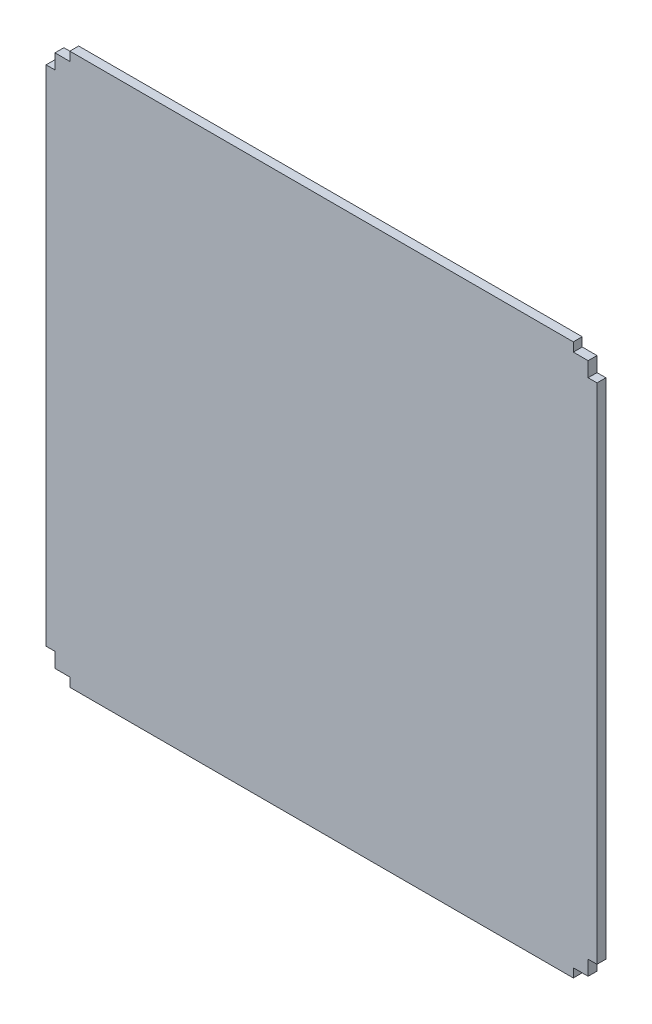
ISO-10303-21;
HEADER;
FILE_DESCRIPTION(('STEP AP214'),'2;1');
FILE_NAME('part.step','',(''),(''),'','','');
FILE_SCHEMA(('AUTOMOTIVE_DESIGN { 1 0 10303 214 1 1 1 1 }'));
ENDSEC;
DATA;
#1=APPLICATION_CONTEXT('core data for automotive mechanical design processes');
#2=APPLICATION_PROTOCOL_DEFINITION('international standard','automotive_design',2000,#1);
#3=PRODUCT_CONTEXT('',#1,'mechanical');
#4=PRODUCT('Part','Part','',(#3));
#5=PRODUCT_RELATED_PRODUCT_CATEGORY('part','',(#4));
#6=PRODUCT_DEFINITION_FORMATION('','',#4);
#7=PRODUCT_DEFINITION_CONTEXT('part definition',#1,'design');
#8=PRODUCT_DEFINITION('design','',#6,#7);
#9=PRODUCT_DEFINITION_SHAPE('','',#8);
#10=(LENGTH_UNIT() NAMED_UNIT(*) SI_UNIT(.MILLI.,.METRE.));
#11=(NAMED_UNIT(*) PLANE_ANGLE_UNIT() SI_UNIT($,.RADIAN.));
#12=(NAMED_UNIT(*) SI_UNIT($,.STERADIAN.) SOLID_ANGLE_UNIT());
#13=UNCERTAINTY_MEASURE_WITH_UNIT(LENGTH_MEASURE(1.E-05),#10,'distance_accuracy_value','');
#14=(GEOMETRIC_REPRESENTATION_CONTEXT(3) GLOBAL_UNCERTAINTY_ASSIGNED_CONTEXT((#13)) GLOBAL_UNIT_ASSIGNED_CONTEXT((#10,
#11,#12)) REPRESENTATION_CONTEXT('',''));
#15=CARTESIAN_POINT('',(0.,0.,0.));
#16=DIRECTION('',(0.,0.,1.));
#17=DIRECTION('',(1.,0.,0.));
#18=AXIS2_PLACEMENT_3D('',#15,#16,#17);
#19=CARTESIAN_POINT('',(0.,0.,3.));
#20=DIRECTION('',(1.,0.,0.));
#21=DIRECTION('',(0.,0.,-1.));
#22=AXIS2_PLACEMENT_3D('',#19,#20,#21);
#23=PLANE('',#22);
#24=DIRECTION('',(0.,-1.,0.));
#25=VECTOR('',#24,1.);
#26=CARTESIAN_POINT('',(0.,0.,0.));
#27=LINE('',#26,#25);
#28=CARTESIAN_POINT('',(0.,5.,0.));
#29=VERTEX_POINT('',#28);
#30=CARTESIAN_POINT('',(0.,0.,0.));
#31=VERTEX_POINT('',#30);
#32=EDGE_CURVE('E212',#29,#31,#27,.T.);
#33=ORIENTED_EDGE('',*,*,#32,.T.);
#34=DIRECTION('',(0.,0.,-1.));
#35=VECTOR('',#34,1.);
#36=CARTESIAN_POINT('',(0.,0.,3.));
#37=LINE('',#36,#35);
#38=CARTESIAN_POINT('',(0.,0.,3.));
#39=VERTEX_POINT('',#38);
#40=EDGE_CURVE('E11',#39,#31,#37,.T.);
#41=ORIENTED_EDGE('',*,*,#40,.F.);
#42=DIRECTION('',(0.,-1.,0.));
#43=VECTOR('',#42,1.);
#44=CARTESIAN_POINT('',(0.,0.,3.));
#45=LINE('',#44,#43);
#46=CARTESIAN_POINT('',(0.,5.,3.));
#47=VERTEX_POINT('',#46);
#48=EDGE_CURVE('E270',#47,#39,#45,.T.);
#49=ORIENTED_EDGE('',*,*,#48,.F.);
#50=DIRECTION('',(0.,0.,-1.));
#51=VECTOR('',#50,1.);
#52=CARTESIAN_POINT('',(0.,5.,3.));
#53=LINE('',#52,#51);
#54=EDGE_CURVE('E208',#47,#29,#53,.T.);
#55=ORIENTED_EDGE('',*,*,#54,.T.);
#56=EDGE_LOOP('',(#33,#41,#49,#55));
#57=FACE_BOUND('',#56,.T.);
#58=ADVANCED_FACE('F39',(#57),#23,.F.);
#59=CARTESIAN_POINT('',(0.,0.,3.));
#60=DIRECTION('',(0.,1.,0.));
#61=DIRECTION('',(0.,0.,1.));
#62=AXIS2_PLACEMENT_3D('',#59,#60,#61);
#63=PLANE('',#62);
#64=DIRECTION('',(1.,0.,0.));
#65=VECTOR('',#64,1.);
#66=CARTESIAN_POINT('',(0.,0.,0.));
#67=LINE('',#66,#65);
#68=CARTESIAN_POINT('',(5.,0.,0.));
#69=VERTEX_POINT('',#68);
#70=EDGE_CURVE('E216',#31,#69,#67,.T.);
#71=ORIENTED_EDGE('',*,*,#70,.T.);
#72=DIRECTION('',(0.,0.,-1.));
#73=VECTOR('',#72,1.);
#74=CARTESIAN_POINT('',(5.,0.,3.));
#75=LINE('',#74,#73);
#76=CARTESIAN_POINT('',(5.,0.,3.));
#77=VERTEX_POINT('',#76);
#78=EDGE_CURVE('E48',#77,#69,#75,.T.);
#79=ORIENTED_EDGE('',*,*,#78,.F.);
#80=DIRECTION('',(1.,0.,0.));
#81=VECTOR('',#80,1.);
#82=CARTESIAN_POINT('',(0.,0.,3.));
#83=LINE('',#82,#81);
#84=EDGE_CURVE('E135',#39,#77,#83,.T.);
#85=ORIENTED_EDGE('',*,*,#84,.F.);
#86=ORIENTED_EDGE('',*,*,#40,.T.);
#87=EDGE_LOOP('',(#71,#79,#85,#86));
#88=FACE_BOUND('',#87,.T.);
#89=ADVANCED_FACE('F420',(#88),#63,.F.);
#90=CARTESIAN_POINT('',(5.,0.,3.));
#91=DIRECTION('',(1.,0.,0.));
#92=DIRECTION('',(0.,0.,-1.));
#93=AXIS2_PLACEMENT_3D('',#90,#91,#92);
#94=PLANE('',#93);
#95=DIRECTION('',(0.,-1.,0.));
#96=VECTOR('',#95,1.);
#97=CARTESIAN_POINT('',(5.,0.,0.));
#98=LINE('',#97,#96);
#99=CARTESIAN_POINT('',(5.,-3.,0.));
#100=VERTEX_POINT('',#99);
#101=EDGE_CURVE('E219',#69,#100,#98,.T.);
#102=ORIENTED_EDGE('',*,*,#101,.T.);
#103=DIRECTION('',(0.,0.,-1.));
#104=VECTOR('',#103,1.);
#105=CARTESIAN_POINT('',(5.,-3.,3.));
#106=LINE('',#105,#104);
#107=CARTESIAN_POINT('',(5.,-3.,3.));
#108=VERTEX_POINT('',#107);
#109=EDGE_CURVE('E329',#108,#100,#106,.T.);
#110=ORIENTED_EDGE('',*,*,#109,.F.);
#111=DIRECTION('',(0.,-1.,0.));
#112=VECTOR('',#111,1.);
#113=CARTESIAN_POINT('',(5.,0.,3.));
#114=LINE('',#113,#112);
#115=EDGE_CURVE('E339',#77,#108,#114,.T.);
#116=ORIENTED_EDGE('',*,*,#115,.F.);
#117=ORIENTED_EDGE('',*,*,#78,.T.);
#118=EDGE_LOOP('',(#102,#110,#116,#117));
#119=FACE_BOUND('',#118,.T.);
#120=ADVANCED_FACE('F337',(#119),#94,.F.);
#121=CARTESIAN_POINT('',(5.,-3.,3.));
#122=DIRECTION('',(0.,1.,0.));
#123=DIRECTION('',(0.,0.,1.));
#124=AXIS2_PLACEMENT_3D('',#121,#122,#123);
#125=PLANE('',#124);
#126=DIRECTION('',(1.,0.,0.));
#127=VECTOR('',#126,1.);
#128=CARTESIAN_POINT('',(5.,-3.,0.));
#129=LINE('',#128,#127);
#130=CARTESIAN_POINT('',(175.,-3.,0.));
#131=VERTEX_POINT('',#130);
#132=EDGE_CURVE('E222',#100,#131,#129,.T.);
#133=ORIENTED_EDGE('',*,*,#132,.T.);
#134=DIRECTION('',(0.,0.,-1.));
#135=VECTOR('',#134,1.);
#136=CARTESIAN_POINT('',(175.,-3.,3.));
#137=LINE('',#136,#135);
#138=CARTESIAN_POINT('',(175.,-3.,3.));
#139=VERTEX_POINT('',#138);
#140=EDGE_CURVE('E325',#139,#131,#137,.T.);
#141=ORIENTED_EDGE('',*,*,#140,.F.);
#142=DIRECTION('',(1.,0.,0.));
#143=VECTOR('',#142,1.);
#144=CARTESIAN_POINT('',(5.,-3.,3.));
#145=LINE('',#144,#143);
#146=EDGE_CURVE('E358',#108,#139,#145,.T.);
#147=ORIENTED_EDGE('',*,*,#146,.F.);
#148=ORIENTED_EDGE('',*,*,#109,.T.);
#149=EDGE_LOOP('',(#133,#141,#147,#148));
#150=FACE_BOUND('',#149,.T.);
#151=ADVANCED_FACE('F348',(#150),#125,.F.);
#152=CARTESIAN_POINT('',(175.,-3.,3.));
#153=DIRECTION('',(-1.,0.,0.));
#154=DIRECTION('',(0.,-1.,0.));
#155=AXIS2_PLACEMENT_3D('',#152,#153,#154);
#156=PLANE('',#155);
#157=DIRECTION('',(0.,1.,0.));
#158=VECTOR('',#157,1.);
#159=CARTESIAN_POINT('',(175.,-3.,0.));
#160=LINE('',#159,#158);
#161=CARTESIAN_POINT('',(175.,0.,0.));
#162=VERTEX_POINT('',#161);
#163=EDGE_CURVE('E225',#131,#162,#160,.T.);
#164=ORIENTED_EDGE('',*,*,#163,.T.);
#165=DIRECTION('',(0.,0.,-1.));
#166=VECTOR('',#165,1.);
#167=CARTESIAN_POINT('',(175.,0.,3.));
#168=LINE('',#167,#166);
#169=CARTESIAN_POINT('',(175.,0.,3.));
#170=VERTEX_POINT('',#169);
#171=EDGE_CURVE('E321',#170,#162,#168,.T.);
#172=ORIENTED_EDGE('',*,*,#171,.F.);
#173=DIRECTION('',(0.,1.,0.));
#174=VECTOR('',#173,1.);
#175=CARTESIAN_POINT('',(175.,-3.,3.));
#176=LINE('',#175,#174);
#177=EDGE_CURVE('E354',#139,#170,#176,.T.);
#178=ORIENTED_EDGE('',*,*,#177,.F.);
#179=ORIENTED_EDGE('',*,*,#140,.T.);
#180=EDGE_LOOP('',(#164,#172,#178,#179));
#181=FACE_BOUND('',#180,.T.);
#182=ADVANCED_FACE('F352',(#181),#156,.F.);
#183=CARTESIAN_POINT('',(175.,0.,3.));
#184=DIRECTION('',(0.,1.,0.));
#185=DIRECTION('',(-1.,0.,0.));
#186=AXIS2_PLACEMENT_3D('',#183,#184,#185);
#187=PLANE('',#186);
#188=DIRECTION('',(1.,0.,0.));
#189=VECTOR('',#188,1.);
#190=CARTESIAN_POINT('',(175.,0.,0.));
#191=LINE('',#190,#189);
#192=CARTESIAN_POINT('',(180.,0.,0.));
#193=VERTEX_POINT('',#192);
#194=EDGE_CURVE('E228',#162,#193,#191,.T.);
#195=ORIENTED_EDGE('',*,*,#194,.T.);
#196=DIRECTION('',(0.,0.,-1.));
#197=VECTOR('',#196,1.);
#198=CARTESIAN_POINT('',(180.,0.,3.));
#199=LINE('',#198,#197);
#200=CARTESIAN_POINT('',(180.,0.,3.));
#201=VERTEX_POINT('',#200);
#202=EDGE_CURVE('E317',#201,#193,#199,.T.);
#203=ORIENTED_EDGE('',*,*,#202,.F.);
#204=DIRECTION('',(1.,0.,0.));
#205=VECTOR('',#204,1.);
#206=CARTESIAN_POINT('',(175.,0.,3.));
#207=LINE('',#206,#205);
#208=EDGE_CURVE('E357',#170,#201,#207,.T.);
#209=ORIENTED_EDGE('',*,*,#208,.F.);
#210=ORIENTED_EDGE('',*,*,#171,.T.);
#211=EDGE_LOOP('',(#195,#203,#209,#210));
#212=FACE_BOUND('',#211,.T.);
#213=ADVANCED_FACE('F433',(#212),#187,.F.);
#214=CARTESIAN_POINT('',(180.,0.,3.));
#215=DIRECTION('',(-1.,0.,0.));
#216=DIRECTION('',(0.,0.,1.));
#217=AXIS2_PLACEMENT_3D('',#214,#215,#216);
#218=PLANE('',#217);
#219=DIRECTION('',(0.,1.,0.));
#220=VECTOR('',#219,1.);
#221=CARTESIAN_POINT('',(180.,0.,0.));
#222=LINE('',#221,#220);
#223=CARTESIAN_POINT('',(180.,5.,0.));
#224=VERTEX_POINT('',#223);
#225=EDGE_CURVE('E231',#193,#224,#222,.T.);
#226=ORIENTED_EDGE('',*,*,#225,.T.);
#227=DIRECTION('',(0.,0.,-1.));
#228=VECTOR('',#227,1.);
#229=CARTESIAN_POINT('',(180.,5.,3.));
#230=LINE('',#229,#228);
#231=CARTESIAN_POINT('',(180.,5.,3.));
#232=VERTEX_POINT('',#231);
#233=EDGE_CURVE('E313',#232,#224,#230,.T.);
#234=ORIENTED_EDGE('',*,*,#233,.F.);
#235=DIRECTION('',(0.,1.,0.));
#236=VECTOR('',#235,1.);
#237=CARTESIAN_POINT('',(180.,0.,3.));
#238=LINE('',#237,#236);
#239=EDGE_CURVE('E362',#201,#232,#238,.T.);
#240=ORIENTED_EDGE('',*,*,#239,.F.);
#241=ORIENTED_EDGE('',*,*,#202,.T.);
#242=EDGE_LOOP('',(#226,#234,#240,#241));
#243=FACE_BOUND('',#242,.T.);
#244=ADVANCED_FACE('F436',(#243),#218,.F.);
#245=CARTESIAN_POINT('',(180.,5.,3.));
#246=DIRECTION('',(0.,1.,0.));
#247=DIRECTION('',(0.,0.,1.));
#248=AXIS2_PLACEMENT_3D('',#245,#246,#247);
#249=PLANE('',#248);
#250=DIRECTION('',(1.,0.,0.));
#251=VECTOR('',#250,1.);
#252=CARTESIAN_POINT('',(180.,5.,0.));
#253=LINE('',#252,#251);
#254=CARTESIAN_POINT('',(183.,5.,0.));
#255=VERTEX_POINT('',#254);
#256=EDGE_CURVE('E234',#224,#255,#253,.T.);
#257=ORIENTED_EDGE('',*,*,#256,.T.);
#258=DIRECTION('',(0.,0.,-1.));
#259=VECTOR('',#258,1.);
#260=CARTESIAN_POINT('',(183.,5.,3.));
#261=LINE('',#260,#259);
#262=CARTESIAN_POINT('',(183.,5.,3.));
#263=VERTEX_POINT('',#262);
#264=EDGE_CURVE('E309',#263,#255,#261,.T.);
#265=ORIENTED_EDGE('',*,*,#264,.F.);
#266=DIRECTION('',(1.,0.,0.));
#267=VECTOR('',#266,1.);
#268=CARTESIAN_POINT('',(180.,5.,3.));
#269=LINE('',#268,#267);
#270=EDGE_CURVE('E369',#232,#263,#269,.T.);
#271=ORIENTED_EDGE('',*,*,#270,.F.);
#272=ORIENTED_EDGE('',*,*,#233,.T.);
#273=EDGE_LOOP('',(#257,#265,#271,#272));
#274=FACE_BOUND('',#273,.T.);
#275=ADVANCED_FACE('F440',(#274),#249,.F.);
#276=CARTESIAN_POINT('',(183.,5.,3.));
#277=DIRECTION('',(-1.,0.,0.));
#278=DIRECTION('',(0.,0.,1.));
#279=AXIS2_PLACEMENT_3D('',#276,#277,#278);
#280=PLANE('',#279);
#281=DIRECTION('',(0.,1.,0.));
#282=VECTOR('',#281,1.);
#283=CARTESIAN_POINT('',(183.,5.,0.));
#284=LINE('',#283,#282);
#285=CARTESIAN_POINT('',(183.,175.,0.));
#286=VERTEX_POINT('',#285);
#287=EDGE_CURVE('E237',#255,#286,#284,.T.);
#288=ORIENTED_EDGE('',*,*,#287,.T.);
#289=DIRECTION('',(0.,0.,-1.));
#290=VECTOR('',#289,1.);
#291=CARTESIAN_POINT('',(183.,175.,3.));
#292=LINE('',#291,#290);
#293=CARTESIAN_POINT('',(183.,175.,3.));
#294=VERTEX_POINT('',#293);
#295=EDGE_CURVE('E305',#294,#286,#292,.T.);
#296=ORIENTED_EDGE('',*,*,#295,.F.);
#297=DIRECTION('',(0.,1.,0.));
#298=VECTOR('',#297,1.);
#299=CARTESIAN_POINT('',(183.,5.,3.));
#300=LINE('',#299,#298);
#301=EDGE_CURVE('E372',#263,#294,#300,.T.);
#302=ORIENTED_EDGE('',*,*,#301,.F.);
#303=ORIENTED_EDGE('',*,*,#264,.T.);
#304=EDGE_LOOP('',(#288,#296,#302,#303));
#305=FACE_BOUND('',#304,.T.);
#306=ADVANCED_FACE('F444',(#305),#280,.F.);
#307=CARTESIAN_POINT('',(183.,175.,3.));
#308=DIRECTION('',(0.,-1.,0.));
#309=DIRECTION('',(1.,0.,0.));
#310=AXIS2_PLACEMENT_3D('',#307,#308,#309);
#311=PLANE('',#310);
#312=DIRECTION('',(-1.,0.,0.));
#313=VECTOR('',#312,1.);
#314=CARTESIAN_POINT('',(183.,175.,0.));
#315=LINE('',#314,#313);
#316=CARTESIAN_POINT('',(180.,175.,0.));
#317=VERTEX_POINT('',#316);
#318=EDGE_CURVE('E240',#286,#317,#315,.T.);
#319=ORIENTED_EDGE('',*,*,#318,.T.);
#320=DIRECTION('',(0.,0.,-1.));
#321=VECTOR('',#320,1.);
#322=CARTESIAN_POINT('',(180.,175.,3.));
#323=LINE('',#322,#321);
#324=CARTESIAN_POINT('',(180.,175.,3.));
#325=VERTEX_POINT('',#324);
#326=EDGE_CURVE('E301',#325,#317,#323,.T.);
#327=ORIENTED_EDGE('',*,*,#326,.F.);
#328=DIRECTION('',(-1.,0.,0.));
#329=VECTOR('',#328,1.);
#330=CARTESIAN_POINT('',(183.,175.,3.));
#331=LINE('',#330,#329);
#332=EDGE_CURVE('E375',#294,#325,#331,.T.);
#333=ORIENTED_EDGE('',*,*,#332,.F.);
#334=ORIENTED_EDGE('',*,*,#295,.T.);
#335=EDGE_LOOP('',(#319,#327,#333,#334));
#336=FACE_BOUND('',#335,.T.);
#337=ADVANCED_FACE('F448',(#336),#311,.F.);
#338=CARTESIAN_POINT('',(180.,175.,3.));
#339=DIRECTION('',(-1.,0.,0.));
#340=DIRECTION('',(0.,0.,1.));
#341=AXIS2_PLACEMENT_3D('',#338,#339,#340);
#342=PLANE('',#341);
#343=DIRECTION('',(0.,1.,0.));
#344=VECTOR('',#343,1.);
#345=CARTESIAN_POINT('',(180.,175.,0.));
#346=LINE('',#345,#344);
#347=CARTESIAN_POINT('',(180.,180.,0.));
#348=VERTEX_POINT('',#347);
#349=EDGE_CURVE('E243',#317,#348,#346,.T.);
#350=ORIENTED_EDGE('',*,*,#349,.T.);
#351=DIRECTION('',(0.,0.,-1.));
#352=VECTOR('',#351,1.);
#353=CARTESIAN_POINT('',(180.,180.,3.));
#354=LINE('',#353,#352);
#355=CARTESIAN_POINT('',(180.,180.,3.));
#356=VERTEX_POINT('',#355);
#357=EDGE_CURVE('E297',#356,#348,#354,.T.);
#358=ORIENTED_EDGE('',*,*,#357,.F.);
#359=DIRECTION('',(0.,1.,0.));
#360=VECTOR('',#359,1.);
#361=CARTESIAN_POINT('',(180.,175.,3.));
#362=LINE('',#361,#360);
#363=EDGE_CURVE('E378',#325,#356,#362,.T.);
#364=ORIENTED_EDGE('',*,*,#363,.F.);
#365=ORIENTED_EDGE('',*,*,#326,.T.);
#366=EDGE_LOOP('',(#350,#358,#364,#365));
#367=FACE_BOUND('',#366,.T.);
#368=ADVANCED_FACE('F452',(#367),#342,.F.);
#369=CARTESIAN_POINT('',(180.,180.,3.));
#370=DIRECTION('',(0.,-1.,0.));
#371=DIRECTION('',(0.,0.,-1.));
#372=AXIS2_PLACEMENT_3D('',#369,#370,#371);
#373=PLANE('',#372);
#374=DIRECTION('',(-1.,0.,0.));
#375=VECTOR('',#374,1.);
#376=CARTESIAN_POINT('',(180.,180.,0.));
#377=LINE('',#376,#375);
#378=CARTESIAN_POINT('',(175.,180.,0.));
#379=VERTEX_POINT('',#378);
#380=EDGE_CURVE('E246',#348,#379,#377,.T.);
#381=ORIENTED_EDGE('',*,*,#380,.T.);
#382=DIRECTION('',(0.,0.,-1.));
#383=VECTOR('',#382,1.);
#384=CARTESIAN_POINT('',(175.,180.,3.));
#385=LINE('',#384,#383);
#386=CARTESIAN_POINT('',(175.,180.,3.));
#387=VERTEX_POINT('',#386);
#388=EDGE_CURVE('E293',#387,#379,#385,.T.);
#389=ORIENTED_EDGE('',*,*,#388,.F.);
#390=DIRECTION('',(-1.,0.,0.));
#391=VECTOR('',#390,1.);
#392=CARTESIAN_POINT('',(180.,180.,3.));
#393=LINE('',#392,#391);
#394=EDGE_CURVE('E381',#356,#387,#393,.T.);
#395=ORIENTED_EDGE('',*,*,#394,.F.);
#396=ORIENTED_EDGE('',*,*,#357,.T.);
#397=EDGE_LOOP('',(#381,#389,#395,#396));
#398=FACE_BOUND('',#397,.T.);
#399=ADVANCED_FACE('F456',(#398),#373,.F.);
#400=CARTESIAN_POINT('',(175.,180.,3.));
#401=DIRECTION('',(-1.,0.,0.));
#402=DIRECTION('',(0.,0.,1.));
#403=AXIS2_PLACEMENT_3D('',#400,#401,#402);
#404=PLANE('',#403);
#405=DIRECTION('',(0.,1.,0.));
#406=VECTOR('',#405,1.);
#407=CARTESIAN_POINT('',(175.,180.,0.));
#408=LINE('',#407,#406);
#409=CARTESIAN_POINT('',(175.,183.,0.));
#410=VERTEX_POINT('',#409);
#411=EDGE_CURVE('E249',#379,#410,#408,.T.);
#412=ORIENTED_EDGE('',*,*,#411,.T.);
#413=DIRECTION('',(0.,0.,-1.));
#414=VECTOR('',#413,1.);
#415=CARTESIAN_POINT('',(175.,183.,3.));
#416=LINE('',#415,#414);
#417=CARTESIAN_POINT('',(175.,183.,3.));
#418=VERTEX_POINT('',#417);
#419=EDGE_CURVE('E289',#418,#410,#416,.T.);
#420=ORIENTED_EDGE('',*,*,#419,.F.);
#421=DIRECTION('',(0.,1.,0.));
#422=VECTOR('',#421,1.);
#423=CARTESIAN_POINT('',(175.,180.,3.));
#424=LINE('',#423,#422);
#425=EDGE_CURVE('E384',#387,#418,#424,.T.);
#426=ORIENTED_EDGE('',*,*,#425,.F.);
#427=ORIENTED_EDGE('',*,*,#388,.T.);
#428=EDGE_LOOP('',(#412,#420,#426,#427));
#429=FACE_BOUND('',#428,.T.);
#430=ADVANCED_FACE('F460',(#429),#404,.F.);
#431=CARTESIAN_POINT('',(175.,183.,3.));
#432=DIRECTION('',(0.,-1.,0.));
#433=DIRECTION('',(0.,0.,-1.));
#434=AXIS2_PLACEMENT_3D('',#431,#432,#433);
#435=PLANE('',#434);
#436=DIRECTION('',(-1.,0.,0.));
#437=VECTOR('',#436,1.);
#438=CARTESIAN_POINT('',(175.,183.,0.));
#439=LINE('',#438,#437);
#440=CARTESIAN_POINT('',(5.,183.,0.));
#441=VERTEX_POINT('',#440);
#442=EDGE_CURVE('E252',#410,#441,#439,.T.);
#443=ORIENTED_EDGE('',*,*,#442,.T.);
#444=DIRECTION('',(0.,0.,-1.));
#445=VECTOR('',#444,1.);
#446=CARTESIAN_POINT('',(5.,183.,3.));
#447=LINE('',#446,#445);
#448=CARTESIAN_POINT('',(5.,183.,3.));
#449=VERTEX_POINT('',#448);
#450=EDGE_CURVE('E285',#449,#441,#447,.T.);
#451=ORIENTED_EDGE('',*,*,#450,.F.);
#452=DIRECTION('',(-1.,0.,0.));
#453=VECTOR('',#452,1.);
#454=CARTESIAN_POINT('',(175.,183.,3.));
#455=LINE('',#454,#453);
#456=EDGE_CURVE('E387',#418,#449,#455,.T.);
#457=ORIENTED_EDGE('',*,*,#456,.F.);
#458=ORIENTED_EDGE('',*,*,#419,.T.);
#459=EDGE_LOOP('',(#443,#451,#457,#458));
#460=FACE_BOUND('',#459,.T.);
#461=ADVANCED_FACE('F464',(#460),#435,.F.);
#462=CARTESIAN_POINT('',(5.,183.,3.));
#463=DIRECTION('',(1.,0.,0.));
#464=DIRECTION('',(0.,1.,0.));
#465=AXIS2_PLACEMENT_3D('',#462,#463,#464);
#466=PLANE('',#465);
#467=DIRECTION('',(0.,-1.,0.));
#468=VECTOR('',#467,1.);
#469=CARTESIAN_POINT('',(5.,183.,0.));
#470=LINE('',#469,#468);
#471=CARTESIAN_POINT('',(5.,180.,0.));
#472=VERTEX_POINT('',#471);
#473=EDGE_CURVE('E255',#441,#472,#470,.T.);
#474=ORIENTED_EDGE('',*,*,#473,.T.);
#475=DIRECTION('',(0.,0.,-1.));
#476=VECTOR('',#475,1.);
#477=CARTESIAN_POINT('',(5.,180.,3.));
#478=LINE('',#477,#476);
#479=CARTESIAN_POINT('',(5.,180.,3.));
#480=VERTEX_POINT('',#479);
#481=EDGE_CURVE('E281',#480,#472,#478,.T.);
#482=ORIENTED_EDGE('',*,*,#481,.F.);
#483=DIRECTION('',(0.,-1.,0.));
#484=VECTOR('',#483,1.);
#485=CARTESIAN_POINT('',(5.,183.,3.));
#486=LINE('',#485,#484);
#487=EDGE_CURVE('E390',#449,#480,#486,.T.);
#488=ORIENTED_EDGE('',*,*,#487,.F.);
#489=ORIENTED_EDGE('',*,*,#450,.T.);
#490=EDGE_LOOP('',(#474,#482,#488,#489));
#491=FACE_BOUND('',#490,.T.);
#492=ADVANCED_FACE('F468',(#491),#466,.F.);
#493=CARTESIAN_POINT('',(0.,180.,3.));
#494=DIRECTION('',(0.,-1.,0.));
#495=DIRECTION('',(0.,0.,-1.));
#496=AXIS2_PLACEMENT_3D('',#493,#494,#495);
#497=PLANE('',#496);
#498=DIRECTION('',(-1.,0.,0.));
#499=VECTOR('',#498,1.);
#500=CARTESIAN_POINT('',(0.,180.,0.));
#501=LINE('',#500,#499);
#502=CARTESIAN_POINT('',(0.,180.,0.));
#503=VERTEX_POINT('',#502);
#504=EDGE_CURVE('E258',#472,#503,#501,.T.);
#505=ORIENTED_EDGE('',*,*,#504,.T.);
#506=DIRECTION('',(0.,0.,-1.));
#507=VECTOR('',#506,1.);
#508=CARTESIAN_POINT('',(0.,180.,3.));
#509=LINE('',#508,#507);
#510=CARTESIAN_POINT('',(0.,180.,3.));
#511=VERTEX_POINT('',#510);
#512=EDGE_CURVE('E277',#511,#503,#509,.T.);
#513=ORIENTED_EDGE('',*,*,#512,.F.);
#514=DIRECTION('',(-1.,0.,0.));
#515=VECTOR('',#514,1.);
#516=CARTESIAN_POINT('',(0.,180.,3.));
#517=LINE('',#516,#515);
#518=EDGE_CURVE('E393',#480,#511,#517,.T.);
#519=ORIENTED_EDGE('',*,*,#518,.F.);
#520=ORIENTED_EDGE('',*,*,#481,.T.);
#521=EDGE_LOOP('',(#505,#513,#519,#520));
#522=FACE_BOUND('',#521,.T.);
#523=ADVANCED_FACE('F401',(#522),#497,.F.);
#524=CARTESIAN_POINT('',(0.,180.,3.));
#525=DIRECTION('',(1.,0.,0.));
#526=DIRECTION('',(0.,0.,-1.));
#527=AXIS2_PLACEMENT_3D('',#524,#525,#526);
#528=PLANE('',#527);
#529=DIRECTION('',(0.,-1.,0.));
#530=VECTOR('',#529,1.);
#531=CARTESIAN_POINT('',(0.,180.,0.));
#532=LINE('',#531,#530);
#533=CARTESIAN_POINT('',(0.,175.,0.));
#534=VERTEX_POINT('',#533);
#535=EDGE_CURVE('E261',#503,#534,#532,.T.);
#536=ORIENTED_EDGE('',*,*,#535,.T.);
#537=DIRECTION('',(0.,0.,-1.));
#538=VECTOR('',#537,1.);
#539=CARTESIAN_POINT('',(0.,175.,3.));
#540=LINE('',#539,#538);
#541=CARTESIAN_POINT('',(0.,175.,3.));
#542=VERTEX_POINT('',#541);
#543=EDGE_CURVE('E201',#542,#534,#540,.T.);
#544=ORIENTED_EDGE('',*,*,#543,.F.);
#545=DIRECTION('',(0.,-1.,0.));
#546=VECTOR('',#545,1.);
#547=CARTESIAN_POINT('',(0.,180.,3.));
#548=LINE('',#547,#546);
#549=EDGE_CURVE('E190',#511,#542,#548,.T.);
#550=ORIENTED_EDGE('',*,*,#549,.F.);
#551=ORIENTED_EDGE('',*,*,#512,.T.);
#552=EDGE_LOOP('',(#536,#544,#550,#551));
#553=FACE_BOUND('',#552,.T.);
#554=ADVANCED_FACE('F405',(#553),#528,.F.);
#555=CARTESIAN_POINT('',(0.,175.,3.));
#556=DIRECTION('',(0.,-1.,0.));
#557=DIRECTION('',(0.,0.,-1.));
#558=AXIS2_PLACEMENT_3D('',#555,#556,#557);
#559=PLANE('',#558);
#560=DIRECTION('',(-1.,0.,0.));
#561=VECTOR('',#560,1.);
#562=CARTESIAN_POINT('',(0.,175.,0.));
#563=LINE('',#562,#561);
#564=CARTESIAN_POINT('',(-3.,175.,0.));
#565=VERTEX_POINT('',#564);
#566=EDGE_CURVE('E199',#534,#565,#563,.T.);
#567=ORIENTED_EDGE('',*,*,#566,.T.);
#568=DIRECTION('',(0.,0.,-1.));
#569=VECTOR('',#568,1.);
#570=CARTESIAN_POINT('',(-3.,175.,3.));
#571=LINE('',#570,#569);
#572=CARTESIAN_POINT('',(-3.,175.,3.));
#573=VERTEX_POINT('',#572);
#574=EDGE_CURVE('E196',#573,#565,#571,.T.);
#575=ORIENTED_EDGE('',*,*,#574,.F.);
#576=DIRECTION('',(-1.,0.,0.));
#577=VECTOR('',#576,1.);
#578=CARTESIAN_POINT('',(0.,175.,3.));
#579=LINE('',#578,#577);
#580=EDGE_CURVE('E184',#542,#573,#579,.T.);
#581=ORIENTED_EDGE('',*,*,#580,.F.);
#582=ORIENTED_EDGE('',*,*,#543,.T.);
#583=EDGE_LOOP('',(#567,#575,#581,#582));
#584=FACE_BOUND('',#583,.T.);
#585=ADVANCED_FACE('F197',(#584),#559,.F.);
#586=CARTESIAN_POINT('',(-3.,5.,3.));
#587=DIRECTION('',(1.,0.,0.));
#588=DIRECTION('',(0.,0.,-1.));
#589=AXIS2_PLACEMENT_3D('',#586,#587,#588);
#590=PLANE('',#589);
#591=DIRECTION('',(0.,-1.,0.));
#592=VECTOR('',#591,1.);
#593=CARTESIAN_POINT('',(-3.,5.,0.));
#594=LINE('',#593,#592);
#595=CARTESIAN_POINT('',(-3.,5.,0.));
#596=VERTEX_POINT('',#595);
#597=EDGE_CURVE('E121',#565,#596,#594,.T.);
#598=ORIENTED_EDGE('',*,*,#597,.T.);
#599=DIRECTION('',(0.,0.,-1.));
#600=VECTOR('',#599,1.);
#601=CARTESIAN_POINT('',(-3.,5.,3.));
#602=LINE('',#601,#600);
#603=CARTESIAN_POINT('',(-3.,5.,3.));
#604=VERTEX_POINT('',#603);
#605=EDGE_CURVE('E202',#604,#596,#602,.T.);
#606=ORIENTED_EDGE('',*,*,#605,.F.);
#607=DIRECTION('',(0.,-1.,0.));
#608=VECTOR('',#607,1.);
#609=CARTESIAN_POINT('',(-3.,5.,3.));
#610=LINE('',#609,#608);
#611=EDGE_CURVE('E188',#573,#604,#610,.T.);
#612=ORIENTED_EDGE('',*,*,#611,.F.);
#613=ORIENTED_EDGE('',*,*,#574,.T.);
#614=EDGE_LOOP('',(#598,#606,#612,#613));
#615=FACE_BOUND('',#614,.T.);
#616=ADVANCED_FACE('F204',(#615),#590,.F.);
#617=CARTESIAN_POINT('',(0.,5.,3.));
#618=DIRECTION('',(0.,1.,0.));
#619=DIRECTION('',(0.,0.,1.));
#620=AXIS2_PLACEMENT_3D('',#617,#618,#619);
#621=PLANE('',#620);
#622=DIRECTION('',(1.,0.,0.));
#623=VECTOR('',#622,1.);
#624=CARTESIAN_POINT('',(0.,5.,0.));
#625=LINE('',#624,#623);
#626=EDGE_CURVE('E127',#596,#29,#625,.T.);
#627=ORIENTED_EDGE('',*,*,#626,.T.);
#628=ORIENTED_EDGE('',*,*,#54,.F.);
#629=DIRECTION('',(1.,0.,0.));
#630=VECTOR('',#629,1.);
#631=CARTESIAN_POINT('',(0.,5.,3.));
#632=LINE('',#631,#630);
#633=EDGE_CURVE('E56',#604,#47,#632,.T.);
#634=ORIENTED_EDGE('',*,*,#633,.F.);
#635=ORIENTED_EDGE('',*,*,#605,.T.);
#636=EDGE_LOOP('',(#627,#628,#634,#635));
#637=FACE_BOUND('',#636,.T.);
#638=ADVANCED_FACE('F409',(#637),#621,.F.);
#639=CARTESIAN_POINT('',(0.,0.,3.));
#640=DIRECTION('',(0.,0.,1.));
#641=DIRECTION('',(1.,0.,0.));
#642=AXIS2_PLACEMENT_3D('',#639,#640,#641);
#643=PLANE('',#642);
#644=ORIENTED_EDGE('',*,*,#48,.T.);
#645=ORIENTED_EDGE('',*,*,#84,.T.);
#646=ORIENTED_EDGE('',*,*,#115,.T.);
#647=ORIENTED_EDGE('',*,*,#146,.T.);
#648=ORIENTED_EDGE('',*,*,#177,.T.);
#649=ORIENTED_EDGE('',*,*,#208,.T.);
#650=ORIENTED_EDGE('',*,*,#239,.T.);
#651=ORIENTED_EDGE('',*,*,#270,.T.);
#652=ORIENTED_EDGE('',*,*,#301,.T.);
#653=ORIENTED_EDGE('',*,*,#332,.T.);
#654=ORIENTED_EDGE('',*,*,#363,.T.);
#655=ORIENTED_EDGE('',*,*,#394,.T.);
#656=ORIENTED_EDGE('',*,*,#425,.T.);
#657=ORIENTED_EDGE('',*,*,#456,.T.);
#658=ORIENTED_EDGE('',*,*,#487,.T.);
#659=ORIENTED_EDGE('',*,*,#518,.T.);
#660=ORIENTED_EDGE('',*,*,#549,.T.);
#661=ORIENTED_EDGE('',*,*,#580,.T.);
#662=ORIENTED_EDGE('',*,*,#611,.T.);
#663=ORIENTED_EDGE('',*,*,#633,.T.);
#664=EDGE_LOOP('',(#644,#645,#646,#647,#648,#649,#650,#651,#652,#653,#654,#655,#656,#657,#658,
#659,#660,#661,#662,#663));
#665=FACE_BOUND('',#664,.T.);
#666=ADVANCED_FACE('F186',(#665),#643,.T.);
#667=CARTESIAN_POINT('',(0.,0.,0.));
#668=DIRECTION('',(0.,0.,1.));
#669=DIRECTION('',(1.,0.,0.));
#670=AXIS2_PLACEMENT_3D('',#667,#668,#669);
#671=PLANE('',#670);
#672=ORIENTED_EDGE('',*,*,#32,.F.);
#673=ORIENTED_EDGE('',*,*,#626,.F.);
#674=ORIENTED_EDGE('',*,*,#597,.F.);
#675=ORIENTED_EDGE('',*,*,#566,.F.);
#676=ORIENTED_EDGE('',*,*,#535,.F.);
#677=ORIENTED_EDGE('',*,*,#504,.F.);
#678=ORIENTED_EDGE('',*,*,#473,.F.);
#679=ORIENTED_EDGE('',*,*,#442,.F.);
#680=ORIENTED_EDGE('',*,*,#411,.F.);
#681=ORIENTED_EDGE('',*,*,#380,.F.);
#682=ORIENTED_EDGE('',*,*,#349,.F.);
#683=ORIENTED_EDGE('',*,*,#318,.F.);
#684=ORIENTED_EDGE('',*,*,#287,.F.);
#685=ORIENTED_EDGE('',*,*,#256,.F.);
#686=ORIENTED_EDGE('',*,*,#225,.F.);
#687=ORIENTED_EDGE('',*,*,#194,.F.);
#688=ORIENTED_EDGE('',*,*,#163,.F.);
#689=ORIENTED_EDGE('',*,*,#132,.F.);
#690=ORIENTED_EDGE('',*,*,#101,.F.);
#691=ORIENTED_EDGE('',*,*,#70,.F.);
#692=EDGE_LOOP('',(#672,#673,#674,#675,#676,#677,#678,#679,#680,#681,#682,#683,#684,#685,#686,
#687,#688,#689,#690,#691));
#693=FACE_BOUND('',#692,.T.);
#694=ADVANCED_FACE('F343',(#693),#671,.F.);
#695=CLOSED_SHELL('',(#58,#89,#120,#151,#182,#213,#244,#275,#306,#337,#368,#399,#430,#461,#492,
#523,#554,#585,#616,#638,#666,#694));
#696=MANIFOLD_SOLID_BREP('B2',#695);
#697=ADVANCED_BREP_SHAPE_REPRESENTATION('',(#18,#696),#14);
#698=SHAPE_DEFINITION_REPRESENTATION(#9,#697);
ENDSEC;
END-ISO-10303-21;
